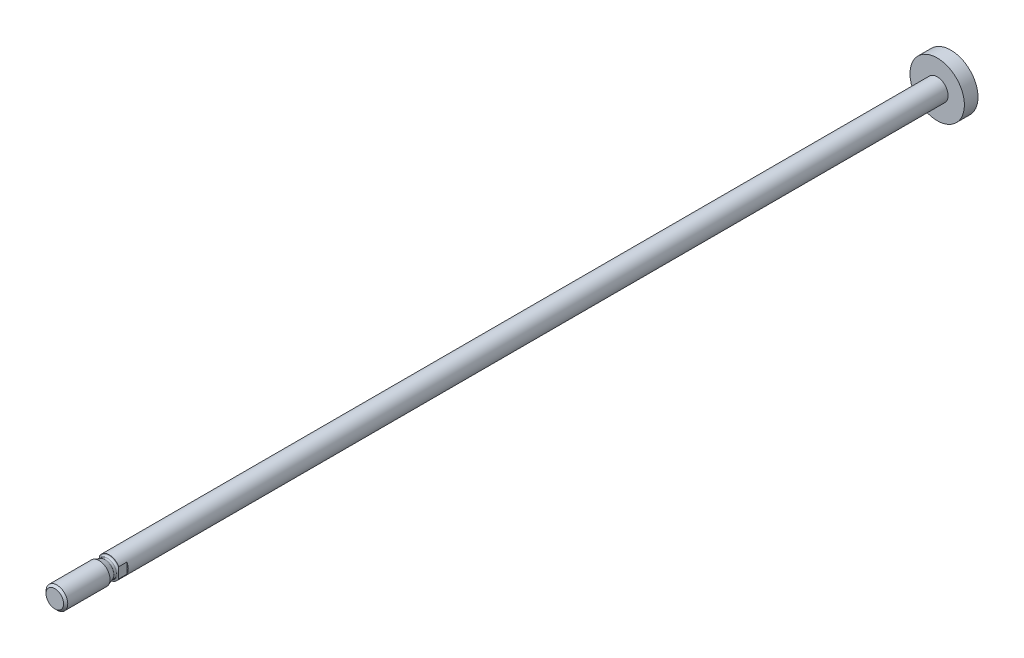
ISO-10303-21;
HEADER;
FILE_DESCRIPTION(('STEP AP214'),'2;1');
FILE_NAME('part.step','',(''),(''),'','','');
FILE_SCHEMA(('AUTOMOTIVE_DESIGN { 1 0 10303 214 1 1 1 1 }'));
ENDSEC;
DATA;
#1=APPLICATION_CONTEXT('core data for automotive mechanical design processes');
#2=APPLICATION_PROTOCOL_DEFINITION('international standard','automotive_design',2000,#1);
#3=PRODUCT_CONTEXT('',#1,'mechanical');
#4=PRODUCT('Part','Part','',(#3));
#5=PRODUCT_RELATED_PRODUCT_CATEGORY('part','',(#4));
#6=PRODUCT_DEFINITION_FORMATION('','',#4);
#7=PRODUCT_DEFINITION_CONTEXT('part definition',#1,'design');
#8=PRODUCT_DEFINITION('design','',#6,#7);
#9=PRODUCT_DEFINITION_SHAPE('','',#8);
#10=(LENGTH_UNIT() NAMED_UNIT(*) SI_UNIT(.MILLI.,.METRE.));
#11=(NAMED_UNIT(*) PLANE_ANGLE_UNIT() SI_UNIT($,.RADIAN.));
#12=(NAMED_UNIT(*) SI_UNIT($,.STERADIAN.) SOLID_ANGLE_UNIT());
#13=UNCERTAINTY_MEASURE_WITH_UNIT(LENGTH_MEASURE(1.E-05),#10,'distance_accuracy_value','');
#14=(GEOMETRIC_REPRESENTATION_CONTEXT(3) GLOBAL_UNCERTAINTY_ASSIGNED_CONTEXT((#13)) GLOBAL_UNIT_ASSIGNED_CONTEXT((#10,
#11,#12)) REPRESENTATION_CONTEXT('',''));
#15=CARTESIAN_POINT('',(0.,0.,0.));
#16=DIRECTION('',(0.,0.,1.));
#17=DIRECTION('',(1.,0.,0.));
#18=AXIS2_PLACEMENT_3D('',#15,#16,#17);
#19=CARTESIAN_POINT('',(0.,0.,4.));
#20=DIRECTION('',(0.,0.,-1.));
#21=DIRECTION('',(-1.,0.,0.));
#22=AXIS2_PLACEMENT_3D('',#19,#20,#21);
#23=PLANE('',#22);
#24=DIRECTION('',(0.,1.,0.));
#25=VECTOR('',#24,1.);
#26=CARTESIAN_POINT('',(-3.5,0.,4.));
#27=LINE('',#26,#25);
#28=CARTESIAN_POINT('',(-3.5,-1.93649167310371,4.));
#29=VERTEX_POINT('',#28);
#30=CARTESIAN_POINT('',(-3.5,-1.47986485869513,4.));
#31=VERTEX_POINT('',#30);
#32=EDGE_CURVE('E50',#29,#31,#27,.T.);
#33=ORIENTED_EDGE('',*,*,#32,.F.);
#34=CARTESIAN_POINT('',(0.,0.,4.));
#35=DIRECTION('',(0.,0.,1.));
#36=DIRECTION('',(1.,0.,0.));
#37=AXIS2_PLACEMENT_3D('',#34,#35,#36);
#38=CIRCLE('',#37,4.);
#39=CARTESIAN_POINT('',(3.5,-1.93649167310371,4.));
#40=VERTEX_POINT('',#39);
#41=EDGE_CURVE('E143',#29,#40,#38,.T.);
#42=ORIENTED_EDGE('',*,*,#41,.T.);
#43=DIRECTION('',(0.,-1.,0.));
#44=VECTOR('',#43,1.);
#45=CARTESIAN_POINT('',(3.5,0.,4.));
#46=LINE('',#45,#44);
#47=CARTESIAN_POINT('',(3.5,-1.47986485869513,3.99999999999992));
#48=VERTEX_POINT('',#47);
#49=EDGE_CURVE('E97',#48,#40,#46,.T.);
#50=ORIENTED_EDGE('',*,*,#49,.F.);
#51=CARTESIAN_POINT('',(0.,0.,4.));
#52=DIRECTION('',(0.,0.,1.));
#53=DIRECTION('',(1.,0.,0.));
#54=AXIS2_PLACEMENT_3D('',#51,#52,#53);
#55=CIRCLE('',#54,3.8000000000001);
#56=EDGE_CURVE('E145',#31,#48,#55,.T.);
#57=ORIENTED_EDGE('',*,*,#56,.F.);
#58=EDGE_LOOP('',(#33,#42,#50,#57));
#59=FACE_BOUND('',#58,.T.);
#60=ADVANCED_FACE('F36',(#59),#23,.F.);
#61=CARTESIAN_POINT('',(-3.5,1.47986485869513,3.99999999999992));
#62=VERTEX_POINT('',#61);
#63=CARTESIAN_POINT('',(-3.5,1.93649167310371,4.));
#64=VERTEX_POINT('',#63);
#65=EDGE_CURVE('E106',#62,#64,#27,.T.);
#66=ORIENTED_EDGE('',*,*,#65,.F.);
#67=CARTESIAN_POINT('',(3.5,1.47986485869513,4.));
#68=VERTEX_POINT('',#67);
#69=EDGE_CURVE('E146',#68,#62,#55,.T.);
#70=ORIENTED_EDGE('',*,*,#69,.F.);
#71=CARTESIAN_POINT('',(3.5,1.93649167310371,4.));
#72=VERTEX_POINT('',#71);
#73=EDGE_CURVE('E58',#72,#68,#46,.T.);
#74=ORIENTED_EDGE('',*,*,#73,.F.);
#75=EDGE_CURVE('E105',#72,#64,#38,.T.);
#76=ORIENTED_EDGE('',*,*,#75,.T.);
#77=EDGE_LOOP('',(#66,#70,#74,#76));
#78=FACE_BOUND('',#77,.T.);
#79=ADVANCED_FACE('F202',(#78),#23,.F.);
#80=CARTESIAN_POINT('',(0.,0.,-305.3));
#81=DIRECTION('',(0.,0.,1.));
#82=DIRECTION('',(1.,0.,0.));
#83=AXIS2_PLACEMENT_3D('',#80,#81,#82);
#84=CYLINDRICAL_SURFACE('',#83,4.);
#85=CARTESIAN_POINT('',(0.,0.,-300.3));
#86=DIRECTION('',(0.,0.,1.));
#87=DIRECTION('',(1.,0.,0.));
#88=AXIS2_PLACEMENT_3D('',#85,#86,#87);
#89=CIRCLE('',#88,4.);
#90=CARTESIAN_POINT('',(4.,0.,-300.3));
#91=VERTEX_POINT('',#90);
#92=EDGE_CURVE('E140',#91,#91,#89,.T.);
#93=ORIENTED_EDGE('',*,*,#92,.T.);
#94=EDGE_LOOP('',(#93));
#95=FACE_BOUND('',#94,.T.);
#96=DIRECTION('',(0.,0.,1.));
#97=VECTOR('',#96,1.);
#98=CARTESIAN_POINT('',(-3.5,-1.93649167310371,-305.3));
#99=LINE('',#98,#97);
#100=CARTESIAN_POINT('',(-3.5,-1.93649167310371,1.));
#101=VERTEX_POINT('',#100);
#102=EDGE_CURVE('E114',#101,#29,#99,.T.);
#103=ORIENTED_EDGE('',*,*,#102,.F.);
#104=CARTESIAN_POINT('',(0.,0.,1.));
#105=DIRECTION('',(0.,0.,1.));
#106=DIRECTION('',(1.,0.,0.));
#107=AXIS2_PLACEMENT_3D('',#104,#105,#106);
#108=CIRCLE('',#107,4.);
#109=CARTESIAN_POINT('',(-3.5,1.93649167310371,1.));
#110=VERTEX_POINT('',#109);
#111=EDGE_CURVE('E11',#110,#101,#108,.T.);
#112=ORIENTED_EDGE('',*,*,#111,.F.);
#113=DIRECTION('',(0.,0.,1.));
#114=VECTOR('',#113,1.);
#115=CARTESIAN_POINT('',(-3.5,1.93649167310371,-305.3));
#116=LINE('',#115,#114);
#117=EDGE_CURVE('E112',#64,#110,#116,.F.);
#118=ORIENTED_EDGE('',*,*,#117,.F.);
#119=ORIENTED_EDGE('',*,*,#75,.F.);
#120=DIRECTION('',(0.,0.,1.));
#121=VECTOR('',#120,1.);
#122=CARTESIAN_POINT('',(3.5,1.93649167310371,-305.3));
#123=LINE('',#122,#121);
#124=CARTESIAN_POINT('',(3.5,1.93649167310371,1.));
#125=VERTEX_POINT('',#124);
#126=EDGE_CURVE('E95',#125,#72,#123,.T.);
#127=ORIENTED_EDGE('',*,*,#126,.F.);
#128=CARTESIAN_POINT('',(3.5,-1.93649167310371,1.));
#129=VERTEX_POINT('',#128);
#130=EDGE_CURVE('E39',#129,#125,#108,.T.);
#131=ORIENTED_EDGE('',*,*,#130,.F.);
#132=DIRECTION('',(0.,0.,1.));
#133=VECTOR('',#132,1.);
#134=CARTESIAN_POINT('',(3.5,-1.93649167310371,-305.3));
#135=LINE('',#134,#133);
#136=EDGE_CURVE('E96',#40,#129,#135,.F.);
#137=ORIENTED_EDGE('',*,*,#136,.F.);
#138=ORIENTED_EDGE('',*,*,#41,.F.);
#139=EDGE_LOOP('',(#103,#112,#118,#119,#127,#131,#137,#138));
#140=FACE_BOUND('',#139,.T.);
#141=ADVANCED_FACE('F102',(#95,#140),#84,.T.);
#142=CARTESIAN_POINT('',(0.,0.,4.6000000000001));
#143=DIRECTION('',(0.,0.,1.));
#144=DIRECTION('',(1.,0.,0.));
#145=AXIS2_PLACEMENT_3D('',#142,#143,#144);
#146=TOROIDAL_SURFACE('',#145,3.8000000000001,0.600000000000099);
#147=CARTESIAN_POINT('',(0.,0.,4.6));
#148=DIRECTION('',(0.,0.,1.));
#149=DIRECTION('',(1.,0.,0.));
#150=AXIS2_PLACEMENT_3D('',#147,#148,#149);
#151=CIRCLE('',#150,3.2);
#152=CARTESIAN_POINT('',(3.2,0.,4.6));
#153=VERTEX_POINT('',#152);
#154=EDGE_CURVE('E131',#153,#153,#151,.T.);
#155=ORIENTED_EDGE('',*,*,#154,.F.);
#156=EDGE_LOOP('',(#155));
#157=FACE_BOUND('',#156,.T.);
#158=CARTESIAN_POINT('',(-3.5,0.,4.08038475772938));
#159=CARTESIAN_POINT('',(-3.5,0.0500062055653644,4.08038579524003));
#160=CARTESIAN_POINT('',(-3.5,0.10001186907905,4.07976142660828));
#161=CARTESIAN_POINT('',(-3.5,0.200008073579427,4.07732415974821));
#162=CARTESIAN_POINT('',(-3.5,0.249998606009498,4.07551091782565));
#163=CARTESIAN_POINT('',(-3.5,0.350023676666661,4.0708553451476));
#164=CARTESIAN_POINT('',(-3.5,0.400058122823757,4.06801109956585));
#165=CARTESIAN_POINT('',(-3.5,0.500067954430721,4.06154909714063));
#166=CARTESIAN_POINT('',(-3.5,0.550043347826766,4.05793146015032));
#167=CARTESIAN_POINT('',(-3.5,0.690839508563253,4.04708094798961));
#168=CARTESIAN_POINT('',(-3.5,0.781617050076563,4.03931230060361));
#169=CARTESIAN_POINT('',(-3.5,0.9632220149238,4.024401341373));
#170=CARTESIAN_POINT('',(-3.5,1.05404943604569,4.01725900370584));
#171=CARTESIAN_POINT('',(-3.5,1.2359337458161,4.00596554667804));
#172=CARTESIAN_POINT('',(-3.5,1.32699066193964,4.00181480438343));
#173=CARTESIAN_POINT('',(-3.5,1.50913050906379,3.99911696420226));
#174=CARTESIAN_POINT('',(-3.5,1.60021331380939,4.00056402453771));
#175=CARTESIAN_POINT('',(-3.5,1.7832512039485,4.01223826838346));
#176=CARTESIAN_POINT('',(-3.5,1.87520111900955,4.02258560378902));
#177=CARTESIAN_POINT('',(-3.5,2.01109807868235,4.04805353771768));
#178=CARTESIAN_POINT('',(-3.5,2.05597275422268,4.05817105079477));
#179=CARTESIAN_POINT('',(-3.5,2.1446015872334,4.08243134215497));
#180=CARTESIAN_POINT('',(-3.5,2.18835703510382,4.09656923395692));
#181=CARTESIAN_POINT('',(-3.5,2.26502423932735,4.12625619760487));
#182=CARTESIAN_POINT('',(-3.5,2.29828717281195,4.14088897580844));
#183=CARTESIAN_POINT('',(-3.5,2.36308366134456,4.17374487362841));
#184=CARTESIAN_POINT('',(-3.5,2.39461486317948,4.1919727313804));
#185=CARTESIAN_POINT('',(-3.5,2.45528633475527,4.2327718563323));
#186=CARTESIAN_POINT('',(-3.5,2.48439672100251,4.25538839857406));
#187=CARTESIAN_POINT('',(-3.5,2.53828325245288,4.30531204058377));
#188=CARTESIAN_POINT('',(-3.5,2.56307231252292,4.33260466298422));
#189=CARTESIAN_POINT('',(-3.5,2.59835539678092,4.38117119923997));
#190=CARTESIAN_POINT('',(-3.5,2.61077480767077,4.40104374871059));
#191=CARTESIAN_POINT('',(-3.5,2.63229473049418,4.44252572441527));
#192=CARTESIAN_POINT('',(-3.5,2.64139766596252,4.4641338682032));
#193=CARTESIAN_POINT('',(-3.5,2.6556780834849,4.50882581532605));
#194=CARTESIAN_POINT('',(-3.5,2.66082330977963,4.53192011572204));
#195=CARTESIAN_POINT('',(-3.5,2.66658722454624,4.57866774033149));
#196=CARTESIAN_POINT('',(-3.5,2.66720861100635,4.60232072290385));
#197=CARTESIAN_POINT('',(-3.5,2.66406334493496,4.64664399355305));
#198=CARTESIAN_POINT('',(-3.5,2.66078189261244,4.66735080097796));
#199=CARTESIAN_POINT('',(-3.5,2.65086769882215,4.70793958933708));
#200=CARTESIAN_POINT('',(-3.5,2.64423425840105,4.72782139730718));
#201=CARTESIAN_POINT('',(-3.5,2.62783818542989,4.76683694228269));
#202=CARTESIAN_POINT('',(-3.5,2.61799948146632,4.78593830149638));
#203=CARTESIAN_POINT('',(-3.5,2.5957864239932,4.8225893297694));
#204=CARTESIAN_POINT('',(-3.5,2.58341098566742,4.84013833036213));
#205=CARTESIAN_POINT('',(-3.5,2.54827666077279,4.88403391197271));
#206=CARTESIAN_POINT('',(-3.5,2.52385245228452,4.90904933157706));
#207=CARTESIAN_POINT('',(-3.5,2.4713802477796,4.95494570673838));
#208=CARTESIAN_POINT('',(-3.5,2.44332184293567,4.97581433256553));
#209=CARTESIAN_POINT('',(-3.5,2.36690919769617,5.02546583684508));
#210=CARTESIAN_POINT('',(-3.5,2.31664003371327,5.05127975894021));
#211=CARTESIAN_POINT('',(-3.5,2.21292774859494,5.09519868885441));
#212=CARTESIAN_POINT('',(-3.5,2.15947928807564,5.11329028588226));
#213=CARTESIAN_POINT('',(-3.5,2.05241854459677,5.14298422713627));
#214=CARTESIAN_POINT('',(-3.5,1.99885008338122,5.15474937556394));
#215=CARTESIAN_POINT('',(-3.5,1.89088555933464,5.17371645891197));
#216=CARTESIAN_POINT('',(-3.5,1.83648865462849,5.18091338377391));
#217=CARTESIAN_POINT('',(-3.5,1.72719420827212,5.19169636188153));
#218=CARTESIAN_POINT('',(-3.5,1.67229565989963,5.19527163434467));
#219=CARTESIAN_POINT('',(-3.5,1.56237784754192,5.19956192851468));
#220=CARTESIAN_POINT('',(-3.5,1.50735854591716,5.20027587383621));
#221=CARTESIAN_POINT('',(-3.5,1.32143089044828,5.19902509431349));
#222=CARTESIAN_POINT('',(-3.5,1.19058803810505,5.1920033327333));
#223=CARTESIAN_POINT('',(-3.5,0.929144323978893,5.17339442832176));
#224=CARTESIAN_POINT('',(-3.5,0.798544182549121,5.161800011167));
#225=CARTESIAN_POINT('',(-3.5,0.602747235241971,5.14602809613734));
#226=CARTESIAN_POINT('',(-3.5,0.537627510492783,5.14104900273235));
#227=CARTESIAN_POINT('',(-3.5,0.407306821786678,5.1323371224062));
#228=CARTESIAN_POINT('',(-3.5,0.342105863988336,5.1286042461649));
#229=CARTESIAN_POINT('',(-3.5,0.211728862091437,5.1229526202353));
#230=CARTESIAN_POINT('',(-3.5,0.146552955128154,5.1210308804655));
#231=CARTESIAN_POINT('',(-3.5,0.0161730194372509,5.11928917221939));
#232=CARTESIAN_POINT('',(-3.5,-0.0490310086083378,5.11946915535245));
#233=CARTESIAN_POINT('',(-3.5,-0.179475576502579,5.12190517622444));
#234=CARTESIAN_POINT('',(-3.5,-0.244716066981349,5.12416369265122));
#235=CARTESIAN_POINT('',(-3.5,-0.375115910587606,5.13040554579892));
#236=CARTESIAN_POINT('',(-3.5,-0.440275258610719,5.13438898602551));
#237=CARTESIAN_POINT('',(-3.5,-0.635895337566246,5.14807827632179));
#238=CARTESIAN_POINT('',(-3.5,-0.76621884732944,5.15951342405818));
#239=CARTESIAN_POINT('',(-3.5,-1.02713131334285,5.18073972163101));
#240=CARTESIAN_POINT('',(-3.5,-1.15772038871775,5.19052976890211));
#241=CARTESIAN_POINT('',(-3.5,-1.35378409785631,5.19852164600105));
#242=CARTESIAN_POINT('',(-3.5,-1.41909161309346,5.2000721709194));
#243=CARTESIAN_POINT('',(-3.5,-1.54969188303483,5.19992263560432));
#244=CARTESIAN_POINT('',(-3.5,-1.61498463760302,5.19822333879744));
#245=CARTESIAN_POINT('',(-3.5,-1.76029290673312,5.18951322581212));
#246=CARTESIAN_POINT('',(-3.5,-1.84025983788535,5.18137635704226));
#247=CARTESIAN_POINT('',(-3.5,-1.95903476517147,5.16210189637695));
#248=CARTESIAN_POINT('',(-3.5,-1.99841540324246,5.15450321251105));
#249=CARTESIAN_POINT('',(-3.5,-2.07652038986955,5.13650653853808));
#250=CARTESIAN_POINT('',(-3.5,-2.11524511477409,5.12611021577707));
#251=CARTESIAN_POINT('',(-3.5,-2.19864889359521,5.0998048910277));
#252=CARTESIAN_POINT('',(-3.5,-2.24312539757502,5.08323620538603));
#253=CARTESIAN_POINT('',(-3.5,-2.32958676042036,5.04443385186534));
#254=CARTESIAN_POINT('',(-3.5,-2.37157403081922,5.022205781053));
#255=CARTESIAN_POINT('',(-3.5,-2.43977528813279,4.97826900973618));
#256=CARTESIAN_POINT('',(-3.5,-2.46706045695041,4.95823818276675));
#257=CARTESIAN_POINT('',(-3.5,-2.51831793755153,4.91428859212922));
#258=CARTESIAN_POINT('',(-3.5,-2.54229604965639,4.89037680000235));
#259=CARTESIAN_POINT('',(-3.5,-2.57970363739195,4.84535217347594));
#260=CARTESIAN_POINT('',(-3.5,-2.59424612037896,4.82517000607983));
#261=CARTESIAN_POINT('',(-3.5,-2.61992505476884,4.78272143024207));
#262=CARTESIAN_POINT('',(-3.5,-2.63106349643882,4.76045624967719));
#263=CARTESIAN_POINT('',(-3.5,-2.64920025698533,4.7140036601898));
#264=CARTESIAN_POINT('',(-3.5,-2.65615513895816,4.68979894460471));
#265=CARTESIAN_POINT('',(-3.5,-2.66504809529779,4.64048613942947));
#266=CARTESIAN_POINT('',(-3.5,-2.66699167521719,4.61537907197386));
#267=CARTESIAN_POINT('',(-3.5,-2.66576972792539,4.56913838413921));
#268=CARTESIAN_POINT('',(-3.5,-2.66333713024049,4.54798188760978));
#269=CARTESIAN_POINT('',(-3.5,-2.65493122425014,4.50638930411087));
#270=CARTESIAN_POINT('',(-3.5,-2.6489573784939,4.4859533269926));
#271=CARTESIAN_POINT('',(-3.5,-2.63391040496586,4.44635032544822));
#272=CARTESIAN_POINT('',(-3.5,-2.62484735225162,4.42717941476791));
#273=CARTESIAN_POINT('',(-3.5,-2.60412982714912,4.39030840624931));
#274=CARTESIAN_POINT('',(-3.5,-2.59247439145874,4.37260885852133));
#275=CARTESIAN_POINT('',(-3.5,-2.55964651342061,4.32891810073296));
#276=CARTESIAN_POINT('',(-3.5,-2.53688962871665,4.30411605633953));
#277=CARTESIAN_POINT('',(-3.5,-2.48775025498198,4.25840323881892));
#278=CARTESIAN_POINT('',(-3.5,-2.46135776993871,4.2375035818933));
#279=CARTESIAN_POINT('',(-3.5,-2.38986954756856,4.18798307162582));
#280=CARTESIAN_POINT('',(-3.5,-2.34291429622141,4.16206577415089));
#281=CARTESIAN_POINT('',(-3.5,-2.24574558542675,4.11749887118979));
#282=CARTESIAN_POINT('',(-3.5,-2.19552624943271,4.09886282247383));
#283=CARTESIAN_POINT('',(-3.5,-2.09587462128469,4.06817578766957));
#284=CARTESIAN_POINT('',(-3.5,-2.04652620992952,4.05584474254379));
#285=CARTESIAN_POINT('',(-3.5,-1.94693895896851,4.0354159388682));
#286=CARTESIAN_POINT('',(-3.5,-1.89669924688715,4.02732259522156));
#287=CARTESIAN_POINT('',(-3.5,-1.74513146101115,4.00812320842939));
#288=CARTESIAN_POINT('',(-3.5,-1.64316995649346,4.00215511449531));
#289=CARTESIAN_POINT('',(-3.5,-1.41246700498561,3.99839333626015));
#290=CARTESIAN_POINT('',(-3.5,-1.28373629994329,4.00316287285656));
#291=CARTESIAN_POINT('',(-3.5,-1.02661753839385,4.01880990476259));
#292=CARTESIAN_POINT('',(-3.5,-0.898230000845064,4.0296939787844));
#293=CARTESIAN_POINT('',(-3.5,-0.705746127745405,4.04568170858882));
#294=CARTESIAN_POINT('',(-3.5,-0.641662853121003,4.05094963535158));
#295=CARTESIAN_POINT('',(-3.5,-0.513433811524688,4.06064102594273));
#296=CARTESIAN_POINT('',(-3.5,-0.449288049445188,4.06506455125933));
#297=CARTESIAN_POINT('',(-3.5,-0.32098353941607,4.07243012154035));
#298=CARTESIAN_POINT('',(-3.5,-0.256824896504214,4.07537391204972));
#299=CARTESIAN_POINT('',(-3.5,-0.128443871708583,4.07935057895739));
#300=CARTESIAN_POINT('',(-3.5,-0.0642214888377097,4.08038342528518));
#301=CARTESIAN_POINT('',(-3.5,0.,4.08038475772938));
#302=B_SPLINE_CURVE_WITH_KNOTS('',3,(#158,#159,#160,#161,#162,#163,#164,#165,#166,#167,#168,
#169,#170,#171,#172,#173,#174,#175,#176,#177,#178,#179,#180,#181,#182,#183,#184,#185,#186,#187,
#188,#189,#190,#191,#192,#193,#194,#195,#196,#197,#198,#199,#200,#201,#202,#203,#204,#205,#206,
#207,#208,#209,#210,#211,#212,#213,#214,#215,#216,#217,#218,#219,#220,#221,#222,#223,#224,#225,
#226,#227,#228,#229,#230,#231,#232,#233,#234,#235,#236,#237,#238,#239,#240,#241,#242,#243,#244,
#245,#246,#247,#248,#249,#250,#251,#252,#253,#254,#255,#256,#257,#258,#259,#260,#261,#262,#263,
#264,#265,#266,#267,#268,#269,#270,#271,#272,#273,#274,#275,#276,#277,#278,#279,#280,#281,#282,
#283,#284,#285,#286,#287,#288,#289,#290,#291,#292,#293,#294,#295,#296,#297,#298,#299,#300,#301),
.UNSPECIFIED.,.T.,.F.,(4,2,2,2,2,2,2,2,2,2,2,2,2,2,2,2,2,2,2,2,2,2,2,2,2,2,2,2,2,2,2,2,2,2,2,2,
2,2,2,2,2,2,2,2,2,2,2,2,2,2,2,2,2,2,2,2,2,2,2,2,2,2,2,2,2,2,2,2,2,2,2,4),(0.,0.150014048798422,
0.300071484653546,0.450409053935331,0.600723342136289,0.874049825720873,1.14736503484109,
1.42071468707779,1.69377915294987,1.97058884479861,2.10845216776641,2.2461486387614,
2.35499514952082,2.46398608488314,2.57416771557531,2.68401418736232,2.75406745328572,
2.8240694241867,2.89463604494047,2.96516057677686,3.02776088906933,3.09037426010844,
3.15459752456243,3.21884831114799,3.32313116232507,3.42771958650061,3.59629393435684,
3.76515985338398,3.92944239010749,4.09390478874738,4.25885532608726,4.42386790935157,
4.81662747336841,5.21001438834882,5.4059342565683,5.60184007960282,5.79742190395237,
5.99299922518425,6.18881007848093,6.38463268321895,6.77711538137523,7.16986008579766,
7.36577121673005,7.56163633117303,7.80230390131153,7.92254416345271,8.04271292251144,
8.18480424522089,8.32675558344215,8.42801297124486,8.5290904393555,8.60345225460728,
8.67777050861516,8.75284763934138,8.82784225307812,8.89141694017011,8.95500127838402,
9.01838019760285,9.08178270722154,9.1821864562108,9.28287198824411,9.44286612854139,
9.60315675421254,9.75552106026109,9.90804378754775,10.2137509318015,10.5998737561413,
10.9864128129893,11.1793105025674,11.372194140224,11.5648497087301,11.7575083088275),.UNSPECIFIED.);
#303=EDGE_CURVE('E93',#31,#62,#302,.T.);
#304=ORIENTED_EDGE('',*,*,#303,.F.);
#305=ORIENTED_EDGE('',*,*,#56,.T.);
#306=CARTESIAN_POINT('',(3.5,0.,4.08038475772938));
#307=CARTESIAN_POINT('',(3.5,-0.0500062055653644,4.08038579524003));
#308=CARTESIAN_POINT('',(3.5,-0.10001186907905,4.07976142660828));
#309=CARTESIAN_POINT('',(3.5,-0.200008073579427,4.07732415974821));
#310=CARTESIAN_POINT('',(3.5,-0.249998606009498,4.07551091782565));
#311=CARTESIAN_POINT('',(3.5,-0.350023676666661,4.0708553451476));
#312=CARTESIAN_POINT('',(3.5,-0.400058122823757,4.06801109956585));
#313=CARTESIAN_POINT('',(3.5,-0.500067954430721,4.06154909714063));
#314=CARTESIAN_POINT('',(3.5,-0.550043347826766,4.05793146015032));
#315=CARTESIAN_POINT('',(3.5,-0.690839508563253,4.04708094798961));
#316=CARTESIAN_POINT('',(3.5,-0.781617050076563,4.03931230060361));
#317=CARTESIAN_POINT('',(3.5,-0.9632220149238,4.024401341373));
#318=CARTESIAN_POINT('',(3.5,-1.05404943604569,4.01725900370584));
#319=CARTESIAN_POINT('',(3.5,-1.2359337458161,4.00596554667804));
#320=CARTESIAN_POINT('',(3.5,-1.32699066193964,4.00181480438343));
#321=CARTESIAN_POINT('',(3.5,-1.50913050906379,3.99911696420226));
#322=CARTESIAN_POINT('',(3.5,-1.60021331380939,4.00056402453771));
#323=CARTESIAN_POINT('',(3.5,-1.7832512039485,4.01223826838346));
#324=CARTESIAN_POINT('',(3.5,-1.87520111900955,4.02258560378902));
#325=CARTESIAN_POINT('',(3.5,-2.01109807868235,4.04805353771768));
#326=CARTESIAN_POINT('',(3.5,-2.05597275422268,4.05817105079477));
#327=CARTESIAN_POINT('',(3.5,-2.1446015872334,4.08243134215497));
#328=CARTESIAN_POINT('',(3.5,-2.18835703510382,4.09656923395692));
#329=CARTESIAN_POINT('',(3.5,-2.26502423932735,4.12625619760487));
#330=CARTESIAN_POINT('',(3.5,-2.29828717281195,4.14088897580844));
#331=CARTESIAN_POINT('',(3.5,-2.36308366134456,4.17374487362841));
#332=CARTESIAN_POINT('',(3.5,-2.39461486317948,4.1919727313804));
#333=CARTESIAN_POINT('',(3.5,-2.45528633475527,4.2327718563323));
#334=CARTESIAN_POINT('',(3.5,-2.48439672100251,4.25538839857406));
#335=CARTESIAN_POINT('',(3.5,-2.53828325245288,4.30531204058377));
#336=CARTESIAN_POINT('',(3.5,-2.56307231252292,4.33260466298422));
#337=CARTESIAN_POINT('',(3.5,-2.59835539678092,4.38117119923997));
#338=CARTESIAN_POINT('',(3.5,-2.61077480767077,4.40104374871059));
#339=CARTESIAN_POINT('',(3.5,-2.63229473049418,4.44252572441527));
#340=CARTESIAN_POINT('',(3.5,-2.64139766596252,4.4641338682032));
#341=CARTESIAN_POINT('',(3.5,-2.6556780834849,4.50882581532605));
#342=CARTESIAN_POINT('',(3.5,-2.66082330977963,4.53192011572204));
#343=CARTESIAN_POINT('',(3.5,-2.66658722454624,4.57866774033149));
#344=CARTESIAN_POINT('',(3.5,-2.66720861100635,4.60232072290385));
#345=CARTESIAN_POINT('',(3.5,-2.66406334493496,4.64664399355305));
#346=CARTESIAN_POINT('',(3.5,-2.66078189261244,4.66735080097796));
#347=CARTESIAN_POINT('',(3.5,-2.65086769882215,4.70793958933708));
#348=CARTESIAN_POINT('',(3.5,-2.64423425840105,4.72782139730718));
#349=CARTESIAN_POINT('',(3.5,-2.62783818542989,4.76683694228269));
#350=CARTESIAN_POINT('',(3.5,-2.61799948146632,4.78593830149638));
#351=CARTESIAN_POINT('',(3.5,-2.5957864239932,4.8225893297694));
#352=CARTESIAN_POINT('',(3.5,-2.58341098566742,4.84013833036213));
#353=CARTESIAN_POINT('',(3.5,-2.54827666077279,4.88403391197271));
#354=CARTESIAN_POINT('',(3.5,-2.52385245228452,4.90904933157706));
#355=CARTESIAN_POINT('',(3.5,-2.4713802477796,4.95494570673838));
#356=CARTESIAN_POINT('',(3.5,-2.44332184293567,4.97581433256553));
#357=CARTESIAN_POINT('',(3.5,-2.36690919769617,5.02546583684508));
#358=CARTESIAN_POINT('',(3.5,-2.31664003371327,5.05127975894021));
#359=CARTESIAN_POINT('',(3.5,-2.21292774859494,5.09519868885441));
#360=CARTESIAN_POINT('',(3.5,-2.15947928807564,5.11329028588226));
#361=CARTESIAN_POINT('',(3.5,-2.05241854459677,5.14298422713627));
#362=CARTESIAN_POINT('',(3.5,-1.99885008338122,5.15474937556394));
#363=CARTESIAN_POINT('',(3.5,-1.89088555933464,5.17371645891197));
#364=CARTESIAN_POINT('',(3.5,-1.83648865462849,5.18091338377391));
#365=CARTESIAN_POINT('',(3.5,-1.72719420827212,5.19169636188153));
#366=CARTESIAN_POINT('',(3.5,-1.67229565989963,5.19527163434467));
#367=CARTESIAN_POINT('',(3.5,-1.56237784754192,5.19956192851468));
#368=CARTESIAN_POINT('',(3.5,-1.50735854591716,5.20027587383621));
#369=CARTESIAN_POINT('',(3.5,-1.32143089044828,5.19902509431349));
#370=CARTESIAN_POINT('',(3.5,-1.19058803810505,5.1920033327333));
#371=CARTESIAN_POINT('',(3.5,-0.929144323978893,5.17339442832176));
#372=CARTESIAN_POINT('',(3.5,-0.798544182549121,5.161800011167));
#373=CARTESIAN_POINT('',(3.5,-0.602747235241971,5.14602809613734));
#374=CARTESIAN_POINT('',(3.5,-0.537627510492783,5.14104900273235));
#375=CARTESIAN_POINT('',(3.5,-0.407306821786678,5.1323371224062));
#376=CARTESIAN_POINT('',(3.5,-0.342105863988336,5.1286042461649));
#377=CARTESIAN_POINT('',(3.5,-0.211728862091437,5.1229526202353));
#378=CARTESIAN_POINT('',(3.5,-0.146552955128154,5.1210308804655));
#379=CARTESIAN_POINT('',(3.5,-0.0161730194372509,5.11928917221939));
#380=CARTESIAN_POINT('',(3.5,0.0490310086083378,5.11946915535245));
#381=CARTESIAN_POINT('',(3.5,0.179475576502579,5.12190517622444));
#382=CARTESIAN_POINT('',(3.5,0.244716066981349,5.12416369265122));
#383=CARTESIAN_POINT('',(3.5,0.375115910587606,5.13040554579892));
#384=CARTESIAN_POINT('',(3.5,0.440275258610719,5.13438898602551));
#385=CARTESIAN_POINT('',(3.5,0.635895337566246,5.14807827632179));
#386=CARTESIAN_POINT('',(3.5,0.76621884732944,5.15951342405818));
#387=CARTESIAN_POINT('',(3.5,1.02713131334285,5.18073972163101));
#388=CARTESIAN_POINT('',(3.5,1.15772038871775,5.19052976890211));
#389=CARTESIAN_POINT('',(3.5,1.35378409785631,5.19852164600105));
#390=CARTESIAN_POINT('',(3.5,1.41909161309346,5.2000721709194));
#391=CARTESIAN_POINT('',(3.5,1.54969188303483,5.19992263560432));
#392=CARTESIAN_POINT('',(3.5,1.61498463760302,5.19822333879744));
#393=CARTESIAN_POINT('',(3.5,1.76029290673312,5.18951322581212));
#394=CARTESIAN_POINT('',(3.5,1.84025983788535,5.18137635704226));
#395=CARTESIAN_POINT('',(3.5,1.95903476517147,5.16210189637695));
#396=CARTESIAN_POINT('',(3.5,1.99841540324246,5.15450321251105));
#397=CARTESIAN_POINT('',(3.5,2.07652038986955,5.13650653853808));
#398=CARTESIAN_POINT('',(3.5,2.11524511477409,5.12611021577707));
#399=CARTESIAN_POINT('',(3.5,2.19864889359521,5.0998048910277));
#400=CARTESIAN_POINT('',(3.5,2.24312539757502,5.08323620538603));
#401=CARTESIAN_POINT('',(3.5,2.32958676042036,5.04443385186534));
#402=CARTESIAN_POINT('',(3.5,2.37157403081922,5.022205781053));
#403=CARTESIAN_POINT('',(3.5,2.43977528813279,4.97826900973618));
#404=CARTESIAN_POINT('',(3.5,2.46706045695041,4.95823818276675));
#405=CARTESIAN_POINT('',(3.5,2.51831793755153,4.91428859212922));
#406=CARTESIAN_POINT('',(3.5,2.54229604965639,4.89037680000235));
#407=CARTESIAN_POINT('',(3.5,2.57970363739195,4.84535217347594));
#408=CARTESIAN_POINT('',(3.5,2.59424612037896,4.82517000607983));
#409=CARTESIAN_POINT('',(3.5,2.61992505476884,4.78272143024207));
#410=CARTESIAN_POINT('',(3.5,2.63106349643882,4.76045624967719));
#411=CARTESIAN_POINT('',(3.5,2.64920025698533,4.7140036601898));
#412=CARTESIAN_POINT('',(3.5,2.65615513895816,4.68979894460471));
#413=CARTESIAN_POINT('',(3.5,2.66504809529779,4.64048613942947));
#414=CARTESIAN_POINT('',(3.5,2.66699167521719,4.61537907197386));
#415=CARTESIAN_POINT('',(3.5,2.66576972792539,4.56913838413921));
#416=CARTESIAN_POINT('',(3.5,2.66333713024049,4.54798188760978));
#417=CARTESIAN_POINT('',(3.5,2.65493122425014,4.50638930411087));
#418=CARTESIAN_POINT('',(3.5,2.6489573784939,4.4859533269926));
#419=CARTESIAN_POINT('',(3.5,2.63391040496586,4.44635032544822));
#420=CARTESIAN_POINT('',(3.5,2.62484735225162,4.42717941476791));
#421=CARTESIAN_POINT('',(3.5,2.60412982714912,4.39030840624931));
#422=CARTESIAN_POINT('',(3.5,2.59247439145874,4.37260885852133));
#423=CARTESIAN_POINT('',(3.5,2.55964651342061,4.32891810073296));
#424=CARTESIAN_POINT('',(3.5,2.53688962871665,4.30411605633953));
#425=CARTESIAN_POINT('',(3.5,2.48775025498198,4.25840323881892));
#426=CARTESIAN_POINT('',(3.5,2.46135776993871,4.2375035818933));
#427=CARTESIAN_POINT('',(3.5,2.38986954756856,4.18798307162582));
#428=CARTESIAN_POINT('',(3.5,2.34291429622141,4.16206577415089));
#429=CARTESIAN_POINT('',(3.5,2.24574558542675,4.11749887118979));
#430=CARTESIAN_POINT('',(3.5,2.19552624943271,4.09886282247383));
#431=CARTESIAN_POINT('',(3.5,2.09587462128469,4.06817578766957));
#432=CARTESIAN_POINT('',(3.5,2.04652620992952,4.05584474254379));
#433=CARTESIAN_POINT('',(3.5,1.94693895896851,4.0354159388682));
#434=CARTESIAN_POINT('',(3.5,1.89669924688715,4.02732259522156));
#435=CARTESIAN_POINT('',(3.5,1.74513146101115,4.00812320842939));
#436=CARTESIAN_POINT('',(3.5,1.64316995649346,4.00215511449531));
#437=CARTESIAN_POINT('',(3.5,1.41246700498561,3.99839333626015));
#438=CARTESIAN_POINT('',(3.5,1.28373629994329,4.00316287285656));
#439=CARTESIAN_POINT('',(3.5,1.02661753839385,4.01880990476259));
#440=CARTESIAN_POINT('',(3.5,0.898230000845064,4.0296939787844));
#441=CARTESIAN_POINT('',(3.5,0.705746127745405,4.04568170858882));
#442=CARTESIAN_POINT('',(3.5,0.641662853121003,4.05094963535158));
#443=CARTESIAN_POINT('',(3.5,0.513433811524688,4.06064102594273));
#444=CARTESIAN_POINT('',(3.5,0.449288049445188,4.06506455125933));
#445=CARTESIAN_POINT('',(3.5,0.32098353941607,4.07243012154035));
#446=CARTESIAN_POINT('',(3.5,0.256824896504214,4.07537391204972));
#447=CARTESIAN_POINT('',(3.5,0.128443871708583,4.07935057895739));
#448=CARTESIAN_POINT('',(3.5,0.0642214888377097,4.08038342528518));
#449=CARTESIAN_POINT('',(3.5,0.,4.08038475772938));
#450=B_SPLINE_CURVE_WITH_KNOTS('',3,(#306,#307,#308,#309,#310,#311,#312,#313,#314,#315,#316,
#317,#318,#319,#320,#321,#322,#323,#324,#325,#326,#327,#328,#329,#330,#331,#332,#333,#334,#335,
#336,#337,#338,#339,#340,#341,#342,#343,#344,#345,#346,#347,#348,#349,#350,#351,#352,#353,#354,
#355,#356,#357,#358,#359,#360,#361,#362,#363,#364,#365,#366,#367,#368,#369,#370,#371,#372,#373,
#374,#375,#376,#377,#378,#379,#380,#381,#382,#383,#384,#385,#386,#387,#388,#389,#390,#391,#392,
#393,#394,#395,#396,#397,#398,#399,#400,#401,#402,#403,#404,#405,#406,#407,#408,#409,#410,#411,
#412,#413,#414,#415,#416,#417,#418,#419,#420,#421,#422,#423,#424,#425,#426,#427,#428,#429,#430,
#431,#432,#433,#434,#435,#436,#437,#438,#439,#440,#441,#442,#443,#444,#445,#446,#447,#448,#449),
.UNSPECIFIED.,.T.,.F.,(4,2,2,2,2,2,2,2,2,2,2,2,2,2,2,2,2,2,2,2,2,2,2,2,2,2,2,2,2,2,2,2,2,2,2,2,
2,2,2,2,2,2,2,2,2,2,2,2,2,2,2,2,2,2,2,2,2,2,2,2,2,2,2,2,2,2,2,2,2,2,2,4),(0.,0.150014048798422,
0.300071484653546,0.450409053935331,0.600723342136289,0.874049825720873,1.14736503484109,
1.42071468707779,1.69377915294987,1.97058884479861,2.10845216776641,2.2461486387614,
2.35499514952082,2.46398608488314,2.57416771557531,2.68401418736232,2.75406745328572,
2.8240694241867,2.89463604494047,2.96516057677686,3.02776088906933,3.09037426010844,
3.15459752456243,3.21884831114799,3.32313116232507,3.42771958650061,3.59629393435684,
3.76515985338398,3.92944239010749,4.09390478874738,4.25885532608726,4.42386790935157,
4.81662747336841,5.21001438834882,5.4059342565683,5.60184007960282,5.79742190395237,
5.99299922518425,6.18881007848093,6.38463268321895,6.77711538137523,7.16986008579766,
7.36577121673005,7.56163633117303,7.80230390131153,7.92254416345271,8.04271292251144,
8.18480424522089,8.32675558344215,8.42801297124486,8.5290904393555,8.60345225460728,
8.67777050861516,8.75284763934138,8.82784225307812,8.89141694017011,8.95500127838402,
9.01838019760285,9.08178270722154,9.1821864562108,9.28287198824411,9.44286612854139,
9.60315675421254,9.75552106026109,9.90804378754775,10.2137509318015,10.5998737561413,
10.9864128129893,11.1793105025674,11.372194140224,11.5648497087301,11.7575083088275),.UNSPECIFIED.);
#451=EDGE_CURVE('E149',#68,#48,#450,.T.);
#452=ORIENTED_EDGE('',*,*,#451,.F.);
#453=ORIENTED_EDGE('',*,*,#69,.T.);
#454=EDGE_LOOP('',(#304,#305,#452,#453));
#455=FACE_BOUND('',#454,.T.);
#456=ADVANCED_FACE('F159',(#157,#455),#146,.F.);
#457=CARTESIAN_POINT('',(0.,4.,-300.3));
#458=DIRECTION('',(0.,0.,-1.));
#459=DIRECTION('',(-1.,0.,0.));
#460=AXIS2_PLACEMENT_3D('',#457,#458,#459);
#461=PLANE('',#460);
#462=ORIENTED_EDGE('',*,*,#92,.F.);
#463=EDGE_LOOP('',(#462));
#464=FACE_BOUND('',#463,.T.);
#465=CARTESIAN_POINT('',(0.,0.,-300.3));
#466=DIRECTION('',(0.,0.,1.));
#467=DIRECTION('',(1.,0.,0.));
#468=AXIS2_PLACEMENT_3D('',#465,#466,#467);
#469=CIRCLE('',#468,10.);
#470=CARTESIAN_POINT('',(10.,0.,-300.3));
#471=VERTEX_POINT('',#470);
#472=EDGE_CURVE('E137',#471,#471,#469,.T.);
#473=ORIENTED_EDGE('',*,*,#472,.T.);
#474=EDGE_LOOP('',(#473));
#475=FACE_BOUND('',#474,.T.);
#476=ADVANCED_FACE('F222',(#464,#475),#461,.F.);
#477=CARTESIAN_POINT('',(0.,0.,-305.3));
#478=DIRECTION('',(0.,0.,1.));
#479=DIRECTION('',(1.,0.,0.));
#480=AXIS2_PLACEMENT_3D('',#477,#478,#479);
#481=CYLINDRICAL_SURFACE('',#480,10.);
#482=ORIENTED_EDGE('',*,*,#472,.F.);
#483=EDGE_LOOP('',(#482));
#484=FACE_BOUND('',#483,.T.);
#485=CARTESIAN_POINT('',(0.,0.,-305.3));
#486=DIRECTION('',(0.,0.,1.));
#487=DIRECTION('',(1.,0.,0.));
#488=AXIS2_PLACEMENT_3D('',#485,#486,#487);
#489=CIRCLE('',#488,10.);
#490=CARTESIAN_POINT('',(10.,0.,-305.3));
#491=VERTEX_POINT('',#490);
#492=EDGE_CURVE('E134',#491,#491,#489,.T.);
#493=ORIENTED_EDGE('',*,*,#492,.T.);
#494=EDGE_LOOP('',(#493));
#495=FACE_BOUND('',#494,.T.);
#496=ADVANCED_FACE('F197',(#484,#495),#481,.T.);
#497=CARTESIAN_POINT('',(0.,10.,-305.3));
#498=DIRECTION('',(0.,0.,1.));
#499=DIRECTION('',(1.,0.,0.));
#500=AXIS2_PLACEMENT_3D('',#497,#498,#499);
#501=PLANE('',#500);
#502=ORIENTED_EDGE('',*,*,#492,.F.);
#503=EDGE_LOOP('',(#502));
#504=FACE_BOUND('',#503,.T.);
#505=ADVANCED_FACE('F192',(#504),#501,.F.);
#506=CARTESIAN_POINT('',(0.,0.,3.));
#507=DIRECTION('',(0.,0.,1.));
#508=DIRECTION('',(1.,0.,0.));
#509=AXIS2_PLACEMENT_3D('',#506,#507,#508);
#510=CYLINDRICAL_SURFACE('',#509,3.2);
#511=CARTESIAN_POINT('',(0.,0.,5.3942038115749));
#512=DIRECTION('',(0.,0.,1.));
#513=DIRECTION('',(1.,0.,0.));
#514=AXIS2_PLACEMENT_3D('',#511,#512,#513);
#515=CIRCLE('',#514,3.2);
#516=CARTESIAN_POINT('',(3.2,0.,5.3942038115749));
#517=VERTEX_POINT('',#516);
#518=EDGE_CURVE('E128',#517,#517,#515,.T.);
#519=ORIENTED_EDGE('',*,*,#518,.F.);
#520=EDGE_LOOP('',(#519));
#521=FACE_BOUND('',#520,.T.);
#522=ORIENTED_EDGE('',*,*,#154,.T.);
#523=EDGE_LOOP('',(#522));
#524=FACE_BOUND('',#523,.T.);
#525=ADVANCED_FACE('F189',(#521,#524),#510,.T.);
#526=CARTESIAN_POINT('',(0.,0.,5.39420381157482));
#527=DIRECTION('',(0.,0.,1.));
#528=DIRECTION('',(1.,0.,0.));
#529=AXIS2_PLACEMENT_3D('',#526,#527,#528);
#530=TOROIDAL_SURFACE('',#529,3.79999999999973,0.599999999999732);
#531=CARTESIAN_POINT('',(0.,0.,5.5994158975703));
#532=DIRECTION('',(0.,0.,1.));
#533=DIRECTION('',(1.,0.,0.));
#534=AXIS2_PLACEMENT_3D('',#531,#532,#533);
#535=CIRCLE('',#534,3.2361844275285);
#536=CARTESIAN_POINT('',(3.2361844275285,0.,5.5994158975703));
#537=VERTEX_POINT('',#536);
#538=EDGE_CURVE('E125',#537,#537,#535,.T.);
#539=ORIENTED_EDGE('',*,*,#538,.F.);
#540=EDGE_LOOP('',(#539));
#541=FACE_BOUND('',#540,.T.);
#542=ORIENTED_EDGE('',*,*,#518,.T.);
#543=EDGE_LOOP('',(#542));
#544=FACE_BOUND('',#543,.T.);
#545=ADVANCED_FACE('F186',(#541,#544),#530,.F.);
#546=CARTESIAN_POINT('',(0.,0.,5.5994158975703));
#547=DIRECTION('',(0.,0.,1.));
#548=DIRECTION('',(1.,0.,0.));
#549=AXIS2_PLACEMENT_3D('',#546,#547,#548);
#550=CONICAL_SURFACE('',#549,3.2361844275285,0.349065850398843);
#551=CARTESIAN_POINT('',(0.,0.,7.6979819355637));
#552=DIRECTION('',(0.,0.,1.));
#553=DIRECTION('',(1.,0.,0.));
#554=AXIS2_PLACEMENT_3D('',#551,#552,#553);
#555=CIRCLE('',#554,4.);
#556=CARTESIAN_POINT('',(4.,0.,7.6979819355637));
#557=VERTEX_POINT('',#556);
#558=EDGE_CURVE('E122',#557,#557,#555,.T.);
#559=ORIENTED_EDGE('',*,*,#558,.F.);
#560=EDGE_LOOP('',(#559));
#561=FACE_BOUND('',#560,.T.);
#562=ORIENTED_EDGE('',*,*,#538,.T.);
#563=EDGE_LOOP('',(#562));
#564=FACE_BOUND('',#563,.T.);
#565=ADVANCED_FACE('F182',(#561,#564),#550,.T.);
#566=CARTESIAN_POINT('',(0.,0.,3.));
#567=DIRECTION('',(0.,0.,1.));
#568=DIRECTION('',(1.,0.,0.));
#569=AXIS2_PLACEMENT_3D('',#566,#567,#568);
#570=CYLINDRICAL_SURFACE('',#569,4.);
#571=CARTESIAN_POINT('',(0.,0.,23.233));
#572=DIRECTION('',(0.,0.,1.));
#573=DIRECTION('',(1.,0.,0.));
#574=AXIS2_PLACEMENT_3D('',#571,#572,#573);
#575=CIRCLE('',#574,4.);
#576=CARTESIAN_POINT('',(4.,0.,23.233));
#577=VERTEX_POINT('',#576);
#578=EDGE_CURVE('E119',#577,#577,#575,.T.);
#579=ORIENTED_EDGE('',*,*,#578,.F.);
#580=EDGE_LOOP('',(#579));
#581=FACE_BOUND('',#580,.T.);
#582=ORIENTED_EDGE('',*,*,#558,.T.);
#583=EDGE_LOOP('',(#582));
#584=FACE_BOUND('',#583,.T.);
#585=ADVANCED_FACE('F178',(#581,#584),#570,.T.);
#586=CARTESIAN_POINT('',(0.,0.,23.233));
#587=DIRECTION('',(0.,0.,-1.));
#588=DIRECTION('',(-1.,0.,0.));
#589=AXIS2_PLACEMENT_3D('',#586,#587,#588);
#590=CONICAL_SURFACE('',#589,4.,0.785398163397448);
#591=CARTESIAN_POINT('',(0.,0.,24.));
#592=DIRECTION('',(0.,0.,1.));
#593=DIRECTION('',(1.,0.,0.));
#594=AXIS2_PLACEMENT_3D('',#591,#592,#593);
#595=CIRCLE('',#594,3.233);
#596=CARTESIAN_POINT('',(3.233,0.,24.));
#597=VERTEX_POINT('',#596);
#598=EDGE_CURVE('E116',#597,#597,#595,.T.);
#599=ORIENTED_EDGE('',*,*,#598,.F.);
#600=EDGE_LOOP('',(#599));
#601=FACE_BOUND('',#600,.T.);
#602=ORIENTED_EDGE('',*,*,#578,.T.);
#603=EDGE_LOOP('',(#602));
#604=FACE_BOUND('',#603,.T.);
#605=ADVANCED_FACE('F174',(#601,#604),#590,.T.);
#606=CARTESIAN_POINT('',(0.,0.,24.));
#607=DIRECTION('',(0.,0.,-1.));
#608=DIRECTION('',(-1.,0.,0.));
#609=AXIS2_PLACEMENT_3D('',#606,#607,#608);
#610=PLANE('',#609);
#611=ORIENTED_EDGE('',*,*,#598,.T.);
#612=EDGE_LOOP('',(#611));
#613=FACE_BOUND('',#612,.T.);
#614=ADVANCED_FACE('F166',(#613),#610,.F.);
#615=CARTESIAN_POINT('',(3.5,7.,5.));
#616=DIRECTION('',(1.,0.,0.));
#617=DIRECTION('',(0.,0.,-1.));
#618=AXIS2_PLACEMENT_3D('',#615,#616,#617);
#619=PLANE('',#618);
#620=ORIENTED_EDGE('',*,*,#126,.T.);
#621=ORIENTED_EDGE('',*,*,#73,.T.);
#622=ORIENTED_EDGE('',*,*,#451,.T.);
#623=ORIENTED_EDGE('',*,*,#49,.T.);
#624=ORIENTED_EDGE('',*,*,#136,.T.);
#625=DIRECTION('',(0.,-1.,0.));
#626=VECTOR('',#625,1.);
#627=CARTESIAN_POINT('',(3.5,7.,1.));
#628=LINE('',#627,#626);
#629=EDGE_CURVE('E89',#125,#129,#628,.T.);
#630=ORIENTED_EDGE('',*,*,#629,.F.);
#631=EDGE_LOOP('',(#620,#621,#622,#623,#624,#630));
#632=FACE_BOUND('',#631,.T.);
#633=ADVANCED_FACE('F94',(#632),#619,.T.);
#634=CARTESIAN_POINT('',(0.,0.,1.));
#635=DIRECTION('',(0.,0.,1.));
#636=DIRECTION('',(1.,0.,0.));
#637=AXIS2_PLACEMENT_3D('',#634,#635,#636);
#638=PLANE('',#637);
#639=ORIENTED_EDGE('',*,*,#130,.T.);
#640=ORIENTED_EDGE('',*,*,#629,.T.);
#641=EDGE_LOOP('',(#639,#640));
#642=FACE_BOUND('',#641,.T.);
#643=ADVANCED_FACE('F88',(#642),#638,.T.);
#644=ORIENTED_EDGE('',*,*,#111,.T.);
#645=DIRECTION('',(0.,1.,0.));
#646=VECTOR('',#645,1.);
#647=CARTESIAN_POINT('',(-3.5,-7.,1.));
#648=LINE('',#647,#646);
#649=EDGE_CURVE('E98',#101,#110,#648,.T.);
#650=ORIENTED_EDGE('',*,*,#649,.T.);
#651=EDGE_LOOP('',(#644,#650));
#652=FACE_BOUND('',#651,.T.);
#653=ADVANCED_FACE('F167',(#652),#638,.T.);
#654=CARTESIAN_POINT('',(-3.5,-7.,5.));
#655=DIRECTION('',(-1.,0.,0.));
#656=DIRECTION('',(0.,0.,1.));
#657=AXIS2_PLACEMENT_3D('',#654,#655,#656);
#658=PLANE('',#657);
#659=ORIENTED_EDGE('',*,*,#102,.T.);
#660=ORIENTED_EDGE('',*,*,#32,.T.);
#661=ORIENTED_EDGE('',*,*,#303,.T.);
#662=ORIENTED_EDGE('',*,*,#65,.T.);
#663=ORIENTED_EDGE('',*,*,#117,.T.);
#664=ORIENTED_EDGE('',*,*,#649,.F.);
#665=EDGE_LOOP('',(#659,#660,#661,#662,#663,#664));
#666=FACE_BOUND('',#665,.T.);
#667=ADVANCED_FACE('F168',(#666),#658,.T.);
#668=CLOSED_SHELL('',(#60,#79,#141,#456,#476,#496,#505,#525,#545,#565,#585,#605,#614,#633,#643,
#653,#667));
#669=MANIFOLD_SOLID_BREP('B2',#668);
#670=ADVANCED_BREP_SHAPE_REPRESENTATION('',(#18,#669),#14);
#671=SHAPE_DEFINITION_REPRESENTATION(#9,#670);
ENDSEC;
END-ISO-10303-21;
